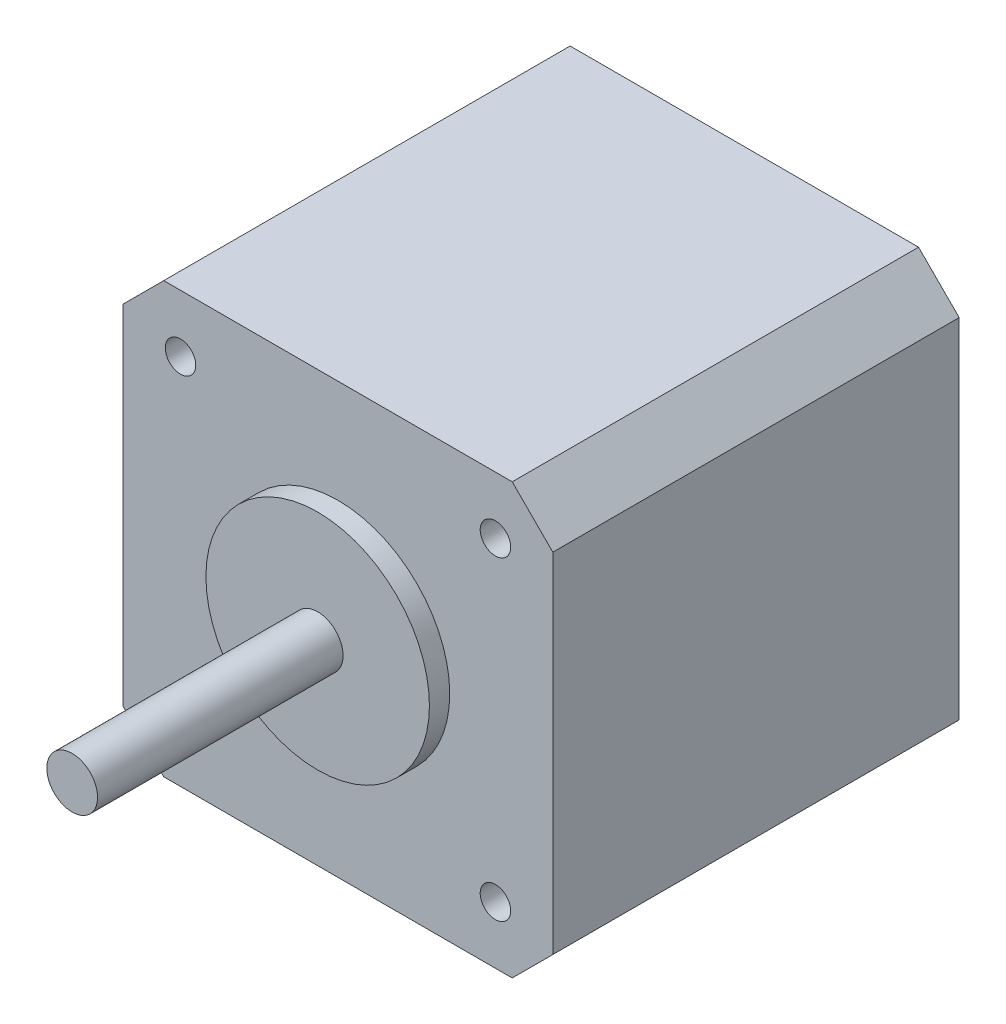
ISO-10303-21;
HEADER;
FILE_DESCRIPTION(('STEP AP214'),'2;1');
FILE_NAME('part.step','',(''),(''),'','','');
FILE_SCHEMA(('AUTOMOTIVE_DESIGN { 1 0 10303 214 1 1 1 1 }'));
ENDSEC;
DATA;
#1=APPLICATION_CONTEXT('core data for automotive mechanical design processes');
#2=APPLICATION_PROTOCOL_DEFINITION('international standard','automotive_design',2000,#1);
#3=PRODUCT_CONTEXT('',#1,'mechanical');
#4=PRODUCT('Part','Part','',(#3));
#5=PRODUCT_RELATED_PRODUCT_CATEGORY('part','',(#4));
#6=PRODUCT_DEFINITION_FORMATION('','',#4);
#7=PRODUCT_DEFINITION_CONTEXT('part definition',#1,'design');
#8=PRODUCT_DEFINITION('design','',#6,#7);
#9=PRODUCT_DEFINITION_SHAPE('','',#8);
#10=(LENGTH_UNIT() NAMED_UNIT(*) SI_UNIT(.MILLI.,.METRE.));
#11=(NAMED_UNIT(*) PLANE_ANGLE_UNIT() SI_UNIT($,.RADIAN.));
#12=(NAMED_UNIT(*) SI_UNIT($,.STERADIAN.) SOLID_ANGLE_UNIT());
#13=UNCERTAINTY_MEASURE_WITH_UNIT(LENGTH_MEASURE(1.E-05),#10,'distance_accuracy_value','');
#14=(GEOMETRIC_REPRESENTATION_CONTEXT(3) GLOBAL_UNCERTAINTY_ASSIGNED_CONTEXT((#13)) GLOBAL_UNIT_ASSIGNED_CONTEXT((#10,
#11,#12)) REPRESENTATION_CONTEXT('',''));
#15=CARTESIAN_POINT('',(0.,0.,0.));
#16=DIRECTION('',(0.,0.,1.));
#17=DIRECTION('',(1.,0.,0.));
#18=AXIS2_PLACEMENT_3D('',#15,#16,#17);
#19=CARTESIAN_POINT('',(0.,0.,0.));
#20=DIRECTION('',(0.,0.,1.));
#21=DIRECTION('',(1.,0.,0.));
#22=AXIS2_PLACEMENT_3D('',#19,#20,#21);
#23=PLANE('',#22);
#24=CARTESIAN_POINT('',(-15.5,-15.5,0.));
#25=DIRECTION('',(0.,0.,1.));
#26=DIRECTION('',(1.,0.,0.));
#27=AXIS2_PLACEMENT_3D('',#24,#25,#26);
#28=CIRCLE('',#27,1.5);
#29=CARTESIAN_POINT('',(-14.,-15.5,0.));
#30=VERTEX_POINT('',#29);
#31=EDGE_CURVE('E212',#30,#30,#28,.T.);
#32=ORIENTED_EDGE('',*,*,#31,.F.);
#33=EDGE_LOOP('',(#32));
#34=FACE_BOUND('',#33,.T.);
#35=CARTESIAN_POINT('',(15.5,-15.5,0.));
#36=DIRECTION('',(0.,0.,1.));
#37=DIRECTION('',(1.,0.,0.));
#38=AXIS2_PLACEMENT_3D('',#35,#36,#37);
#39=CIRCLE('',#38,1.5);
#40=CARTESIAN_POINT('',(17.,-15.5,0.));
#41=VERTEX_POINT('',#40);
#42=EDGE_CURVE('E206',#41,#41,#39,.T.);
#43=ORIENTED_EDGE('',*,*,#42,.F.);
#44=EDGE_LOOP('',(#43));
#45=FACE_BOUND('',#44,.T.);
#46=CARTESIAN_POINT('',(15.5,15.5,0.));
#47=DIRECTION('',(0.,0.,1.));
#48=DIRECTION('',(1.,0.,0.));
#49=AXIS2_PLACEMENT_3D('',#46,#47,#48);
#50=CIRCLE('',#49,1.5);
#51=CARTESIAN_POINT('',(17.,15.5,0.));
#52=VERTEX_POINT('',#51);
#53=EDGE_CURVE('E200',#52,#52,#50,.T.);
#54=ORIENTED_EDGE('',*,*,#53,.F.);
#55=EDGE_LOOP('',(#54));
#56=FACE_BOUND('',#55,.T.);
#57=CARTESIAN_POINT('',(-15.5,15.5,0.));
#58=DIRECTION('',(0.,0.,1.));
#59=DIRECTION('',(1.,0.,0.));
#60=AXIS2_PLACEMENT_3D('',#57,#58,#59);
#61=CIRCLE('',#60,1.5);
#62=CARTESIAN_POINT('',(-14.,15.5,0.));
#63=VERTEX_POINT('',#62);
#64=EDGE_CURVE('E194',#63,#63,#61,.T.);
#65=ORIENTED_EDGE('',*,*,#64,.F.);
#66=EDGE_LOOP('',(#65));
#67=FACE_BOUND('',#66,.T.);
#68=DIRECTION('',(0.,1.,0.));
#69=VECTOR('',#68,1.);
#70=CARTESIAN_POINT('',(21.15,21.15,0.));
#71=LINE('',#70,#69);
#72=CARTESIAN_POINT('',(21.15,-17.15,0.));
#73=VERTEX_POINT('',#72);
#74=CARTESIAN_POINT('',(21.15,17.15,0.));
#75=VERTEX_POINT('',#74);
#76=EDGE_CURVE('E103',#73,#75,#71,.T.);
#77=ORIENTED_EDGE('',*,*,#76,.T.);
#78=DIRECTION('',(0.707106781186546,-0.707106781186549,0.));
#79=VECTOR('',#78,1.);
#80=CARTESIAN_POINT('',(19.15,19.15,0.));
#81=LINE('',#80,#79);
#82=CARTESIAN_POINT('',(17.15,21.15,0.));
#83=VERTEX_POINT('',#82);
#84=EDGE_CURVE('E109',#75,#83,#81,.F.);
#85=ORIENTED_EDGE('',*,*,#84,.T.);
#86=DIRECTION('',(-1.,0.,0.));
#87=VECTOR('',#86,1.);
#88=CARTESIAN_POINT('',(-21.15,21.15,0.));
#89=LINE('',#88,#87);
#90=CARTESIAN_POINT('',(-17.15,21.15,0.));
#91=VERTEX_POINT('',#90);
#92=EDGE_CURVE('E119',#83,#91,#89,.T.);
#93=ORIENTED_EDGE('',*,*,#92,.T.);
#94=DIRECTION('',(0.707106781186549,0.707106781186546,0.));
#95=VECTOR('',#94,1.);
#96=CARTESIAN_POINT('',(-19.15,19.15,0.));
#97=LINE('',#96,#95);
#98=CARTESIAN_POINT('',(-21.15,17.15,0.));
#99=VERTEX_POINT('',#98);
#100=EDGE_CURVE('E124',#91,#99,#97,.F.);
#101=ORIENTED_EDGE('',*,*,#100,.T.);
#102=DIRECTION('',(0.,-1.,0.));
#103=VECTOR('',#102,1.);
#104=CARTESIAN_POINT('',(-21.15,21.15,0.));
#105=LINE('',#104,#103);
#106=CARTESIAN_POINT('',(-21.15,-17.1499999999999,0.));
#107=VERTEX_POINT('',#106);
#108=EDGE_CURVE('E157',#99,#107,#105,.T.);
#109=ORIENTED_EDGE('',*,*,#108,.T.);
#110=DIRECTION('',(-0.707106781186548,0.707106781186548,0.));
#111=VECTOR('',#110,1.);
#112=CARTESIAN_POINT('',(-19.15,-19.15,0.));
#113=LINE('',#112,#111);
#114=CARTESIAN_POINT('',(-17.15,-21.15,0.));
#115=VERTEX_POINT('',#114);
#116=EDGE_CURVE('E110',#107,#115,#113,.F.);
#117=ORIENTED_EDGE('',*,*,#116,.T.);
#118=DIRECTION('',(1.,0.,0.));
#119=VECTOR('',#118,1.);
#120=CARTESIAN_POINT('',(-21.15,-21.15,0.));
#121=LINE('',#120,#119);
#122=CARTESIAN_POINT('',(17.15,-21.15,0.));
#123=VERTEX_POINT('',#122);
#124=EDGE_CURVE('E104',#115,#123,#121,.T.);
#125=ORIENTED_EDGE('',*,*,#124,.T.);
#126=DIRECTION('',(-0.707106781186548,-0.707106781186548,0.));
#127=VECTOR('',#126,1.);
#128=CARTESIAN_POINT('',(19.15,-19.15,0.));
#129=LINE('',#128,#127);
#130=EDGE_CURVE('E100',#123,#73,#129,.F.);
#131=ORIENTED_EDGE('',*,*,#130,.T.);
#132=EDGE_LOOP('',(#77,#85,#93,#101,#109,#117,#125,#131));
#133=FACE_BOUND('',#132,.T.);
#134=CARTESIAN_POINT('',(0.,0.,0.));
#135=DIRECTION('',(0.,0.,-1.));
#136=DIRECTION('',(-1.,0.,0.));
#137=AXIS2_PLACEMENT_3D('',#134,#135,#136);
#138=CIRCLE('',#137,11.);
#139=CARTESIAN_POINT('',(-11.,0.,0.));
#140=VERTEX_POINT('',#139);
#141=EDGE_CURVE('E190',#140,#140,#138,.T.);
#142=ORIENTED_EDGE('',*,*,#141,.T.);
#143=EDGE_LOOP('',(#142));
#144=FACE_BOUND('',#143,.T.);
#145=ADVANCED_FACE('F33',(#34,#45,#56,#67,#133,#144),#23,.T.);
#146=CARTESIAN_POINT('',(-21.15,21.15,-40.));
#147=DIRECTION('',(-1.,0.,0.));
#148=DIRECTION('',(0.,-1.,0.));
#149=AXIS2_PLACEMENT_3D('',#146,#147,#148);
#150=PLANE('',#149);
#151=DIRECTION('',(0.,-1.,0.));
#152=VECTOR('',#151,1.);
#153=CARTESIAN_POINT('',(-21.15,21.15,-40.));
#154=LINE('',#153,#152);
#155=CARTESIAN_POINT('',(-21.15,17.15,-40.));
#156=VERTEX_POINT('',#155);
#157=CARTESIAN_POINT('',(-21.15,-17.15,-40.));
#158=VERTEX_POINT('',#157);
#159=EDGE_CURVE('E154',#156,#158,#154,.T.);
#160=ORIENTED_EDGE('',*,*,#159,.T.);
#161=DIRECTION('',(0.,0.,1.));
#162=VECTOR('',#161,1.);
#163=CARTESIAN_POINT('',(-21.15,-17.15,-40.));
#164=LINE('',#163,#162);
#165=EDGE_CURVE('E11',#158,#107,#164,.T.);
#166=ORIENTED_EDGE('',*,*,#165,.T.);
#167=ORIENTED_EDGE('',*,*,#108,.F.);
#168=DIRECTION('',(0.,0.,-1.));
#169=VECTOR('',#168,1.);
#170=CARTESIAN_POINT('',(-21.15,17.15,-40.));
#171=LINE('',#170,#169);
#172=EDGE_CURVE('E41',#99,#156,#171,.T.);
#173=ORIENTED_EDGE('',*,*,#172,.T.);
#174=EDGE_LOOP('',(#160,#166,#167,#173));
#175=FACE_BOUND('',#174,.T.);
#176=ADVANCED_FACE('F153',(#175),#150,.T.);
#177=CARTESIAN_POINT('',(-21.15,21.15,-40.));
#178=DIRECTION('',(0.,1.,0.));
#179=DIRECTION('',(0.,0.,1.));
#180=AXIS2_PLACEMENT_3D('',#177,#178,#179);
#181=PLANE('',#180);
#182=ORIENTED_EDGE('',*,*,#92,.F.);
#183=DIRECTION('',(0.,0.,-1.));
#184=VECTOR('',#183,1.);
#185=CARTESIAN_POINT('',(17.15,21.15,-40.));
#186=LINE('',#185,#184);
#187=CARTESIAN_POINT('',(17.15,21.15,-40.));
#188=VERTEX_POINT('',#187);
#189=EDGE_CURVE('E137',#83,#188,#186,.T.);
#190=ORIENTED_EDGE('',*,*,#189,.T.);
#191=DIRECTION('',(-1.,0.,0.));
#192=VECTOR('',#191,1.);
#193=CARTESIAN_POINT('',(-21.15,21.15,-40.));
#194=LINE('',#193,#192);
#195=CARTESIAN_POINT('',(-17.15,21.15,-40.));
#196=VERTEX_POINT('',#195);
#197=EDGE_CURVE('E122',#188,#196,#194,.T.);
#198=ORIENTED_EDGE('',*,*,#197,.T.);
#199=DIRECTION('',(0.,0.,1.));
#200=VECTOR('',#199,1.);
#201=CARTESIAN_POINT('',(-17.15,21.15,-40.));
#202=LINE('',#201,#200);
#203=EDGE_CURVE('E134',#196,#91,#202,.T.);
#204=ORIENTED_EDGE('',*,*,#203,.T.);
#205=EDGE_LOOP('',(#182,#190,#198,#204));
#206=FACE_BOUND('',#205,.T.);
#207=ADVANCED_FACE('F169',(#206),#181,.T.);
#208=CARTESIAN_POINT('',(21.15,21.15,-40.));
#209=DIRECTION('',(1.,0.,0.));
#210=DIRECTION('',(0.,1.,0.));
#211=AXIS2_PLACEMENT_3D('',#208,#209,#210);
#212=PLANE('',#211);
#213=DIRECTION('',(0.,1.,0.));
#214=VECTOR('',#213,1.);
#215=CARTESIAN_POINT('',(21.15,21.15,-40.));
#216=LINE('',#215,#214);
#217=CARTESIAN_POINT('',(21.15,-17.15,-40.));
#218=VERTEX_POINT('',#217);
#219=CARTESIAN_POINT('',(21.15,17.15,-40.));
#220=VERTEX_POINT('',#219);
#221=EDGE_CURVE('E127',#218,#220,#216,.T.);
#222=ORIENTED_EDGE('',*,*,#221,.T.);
#223=DIRECTION('',(0.,0.,1.));
#224=VECTOR('',#223,1.);
#225=CARTESIAN_POINT('',(21.15,17.15,-40.));
#226=LINE('',#225,#224);
#227=EDGE_CURVE('E118',#220,#75,#226,.T.);
#228=ORIENTED_EDGE('',*,*,#227,.T.);
#229=ORIENTED_EDGE('',*,*,#76,.F.);
#230=DIRECTION('',(0.,0.,-1.));
#231=VECTOR('',#230,1.);
#232=CARTESIAN_POINT('',(21.15,-17.15,-40.));
#233=LINE('',#232,#231);
#234=EDGE_CURVE('E116',#73,#218,#233,.T.);
#235=ORIENTED_EDGE('',*,*,#234,.T.);
#236=EDGE_LOOP('',(#222,#228,#229,#235));
#237=FACE_BOUND('',#236,.T.);
#238=ADVANCED_FACE('F115',(#237),#212,.T.);
#239=CARTESIAN_POINT('',(-21.15,-21.15,-40.));
#240=DIRECTION('',(0.,-1.,0.));
#241=DIRECTION('',(0.,0.,-1.));
#242=AXIS2_PLACEMENT_3D('',#239,#240,#241);
#243=PLANE('',#242);
#244=DIRECTION('',(1.,0.,0.));
#245=VECTOR('',#244,1.);
#246=CARTESIAN_POINT('',(-21.15,-21.15,-40.));
#247=LINE('',#246,#245);
#248=CARTESIAN_POINT('',(-17.15,-21.15,-40.));
#249=VERTEX_POINT('',#248);
#250=CARTESIAN_POINT('',(17.15,-21.15,-40.));
#251=VERTEX_POINT('',#250);
#252=EDGE_CURVE('E163',#249,#251,#247,.T.);
#253=ORIENTED_EDGE('',*,*,#252,.T.);
#254=DIRECTION('',(0.,0.,1.));
#255=VECTOR('',#254,1.);
#256=CARTESIAN_POINT('',(17.15,-21.15,-40.));
#257=LINE('',#256,#255);
#258=EDGE_CURVE('E147',#251,#123,#257,.T.);
#259=ORIENTED_EDGE('',*,*,#258,.T.);
#260=ORIENTED_EDGE('',*,*,#124,.F.);
#261=DIRECTION('',(0.,0.,-1.));
#262=VECTOR('',#261,1.);
#263=CARTESIAN_POINT('',(-17.15,-21.15,-40.));
#264=LINE('',#263,#262);
#265=EDGE_CURVE('E55',#115,#249,#264,.T.);
#266=ORIENTED_EDGE('',*,*,#265,.T.);
#267=EDGE_LOOP('',(#253,#259,#260,#266));
#268=FACE_BOUND('',#267,.T.);
#269=ADVANCED_FACE('F235',(#268),#243,.T.);
#270=CARTESIAN_POINT('',(0.,0.,-40.));
#271=DIRECTION('',(0.,0.,1.));
#272=DIRECTION('',(1.,0.,0.));
#273=AXIS2_PLACEMENT_3D('',#270,#271,#272);
#274=PLANE('',#273);
#275=CARTESIAN_POINT('',(0.,0.,-40.));
#276=DIRECTION('',(0.,0.,-1.));
#277=DIRECTION('',(-1.,0.,0.));
#278=AXIS2_PLACEMENT_3D('',#275,#276,#277);
#279=CIRCLE('',#278,4.625);
#280=CARTESIAN_POINT('',(-4.625,0.,-40.));
#281=VERTEX_POINT('',#280);
#282=EDGE_CURVE('E218',#281,#281,#279,.T.);
#283=ORIENTED_EDGE('',*,*,#282,.F.);
#284=EDGE_LOOP('',(#283));
#285=FACE_BOUND('',#284,.T.);
#286=ORIENTED_EDGE('',*,*,#197,.F.);
#287=DIRECTION('',(-0.707106781186546,0.707106781186549,0.));
#288=VECTOR('',#287,1.);
#289=CARTESIAN_POINT('',(21.15,17.15,-40.));
#290=LINE('',#289,#288);
#291=EDGE_CURVE('E144',#188,#220,#290,.F.);
#292=ORIENTED_EDGE('',*,*,#291,.T.);
#293=ORIENTED_EDGE('',*,*,#221,.F.);
#294=DIRECTION('',(0.707106781186548,0.707106781186548,0.));
#295=VECTOR('',#294,1.);
#296=CARTESIAN_POINT('',(17.15,-21.15,-40.));
#297=LINE('',#296,#295);
#298=EDGE_CURVE('E48',#218,#251,#297,.F.);
#299=ORIENTED_EDGE('',*,*,#298,.T.);
#300=ORIENTED_EDGE('',*,*,#252,.F.);
#301=DIRECTION('',(0.707106781186548,-0.707106781186548,0.));
#302=VECTOR('',#301,1.);
#303=CARTESIAN_POINT('',(-21.15,-17.15,-40.));
#304=LINE('',#303,#302);
#305=EDGE_CURVE('E141',#249,#158,#304,.F.);
#306=ORIENTED_EDGE('',*,*,#305,.T.);
#307=ORIENTED_EDGE('',*,*,#159,.F.);
#308=DIRECTION('',(-0.707106781186549,-0.707106781186546,0.));
#309=VECTOR('',#308,1.);
#310=CARTESIAN_POINT('',(-17.15,21.15,-40.));
#311=LINE('',#310,#309);
#312=EDGE_CURVE('E139',#156,#196,#311,.F.);
#313=ORIENTED_EDGE('',*,*,#312,.T.);
#314=EDGE_LOOP('',(#286,#292,#293,#299,#300,#306,#307,#313));
#315=FACE_BOUND('',#314,.T.);
#316=ADVANCED_FACE('F161',(#285,#315),#274,.F.);
#317=CARTESIAN_POINT('',(0.,0.,26.1637247331365));
#318=DIRECTION('',(0.,0.,-1.));
#319=DIRECTION('',(-1.,0.,0.));
#320=AXIS2_PLACEMENT_3D('',#317,#318,#319);
#321=PLANE('',#320);
#322=CARTESIAN_POINT('',(0.,0.,26.1637247331365));
#323=DIRECTION('',(0.,0.,-1.));
#324=DIRECTION('',(-1.,0.,0.));
#325=AXIS2_PLACEMENT_3D('',#322,#323,#324);
#326=CIRCLE('',#325,2.5);
#327=CARTESIAN_POINT('',(-2.5,0.,26.1637247331365));
#328=VERTEX_POINT('',#327);
#329=EDGE_CURVE('E178',#328,#328,#326,.T.);
#330=ORIENTED_EDGE('',*,*,#329,.F.);
#331=EDGE_LOOP('',(#330));
#332=FACE_BOUND('',#331,.T.);
#333=ADVANCED_FACE('F234',(#332),#321,.F.);
#334=CARTESIAN_POINT('',(0.,0.,0.));
#335=DIRECTION('',(0.,0.,-1.));
#336=DIRECTION('',(-1.,0.,0.));
#337=AXIS2_PLACEMENT_3D('',#334,#335,#336);
#338=CYLINDRICAL_SURFACE('',#337,2.5);
#339=CARTESIAN_POINT('',(0.,0.,2.));
#340=DIRECTION('',(0.,0.,-1.));
#341=DIRECTION('',(-1.,0.,0.));
#342=AXIS2_PLACEMENT_3D('',#339,#340,#341);
#343=CIRCLE('',#342,2.5);
#344=CARTESIAN_POINT('',(-2.5,0.,2.));
#345=VERTEX_POINT('',#344);
#346=EDGE_CURVE('E180',#345,#345,#343,.T.);
#347=ORIENTED_EDGE('',*,*,#346,.F.);
#348=EDGE_LOOP('',(#347));
#349=FACE_BOUND('',#348,.T.);
#350=ORIENTED_EDGE('',*,*,#329,.T.);
#351=EDGE_LOOP('',(#350));
#352=FACE_BOUND('',#351,.T.);
#353=ADVANCED_FACE('F241',(#349,#352),#338,.T.);
#354=CARTESIAN_POINT('',(11.,0.,2.));
#355=DIRECTION('',(0.,0.,-1.));
#356=DIRECTION('',(-1.,0.,0.));
#357=AXIS2_PLACEMENT_3D('',#354,#355,#356);
#358=PLANE('',#357);
#359=CARTESIAN_POINT('',(0.,0.,2.));
#360=DIRECTION('',(0.,0.,-1.));
#361=DIRECTION('',(-1.,0.,0.));
#362=AXIS2_PLACEMENT_3D('',#359,#360,#361);
#363=CIRCLE('',#362,11.);
#364=CARTESIAN_POINT('',(-11.,0.,2.));
#365=VERTEX_POINT('',#364);
#366=EDGE_CURVE('E185',#365,#365,#363,.T.);
#367=ORIENTED_EDGE('',*,*,#366,.F.);
#368=EDGE_LOOP('',(#367));
#369=FACE_BOUND('',#368,.T.);
#370=ORIENTED_EDGE('',*,*,#346,.T.);
#371=EDGE_LOOP('',(#370));
#372=FACE_BOUND('',#371,.T.);
#373=ADVANCED_FACE('F288',(#369,#372),#358,.F.);
#374=CARTESIAN_POINT('',(0.,0.,0.));
#375=DIRECTION('',(0.,0.,-1.));
#376=DIRECTION('',(-1.,0.,0.));
#377=AXIS2_PLACEMENT_3D('',#374,#375,#376);
#378=CYLINDRICAL_SURFACE('',#377,11.);
#379=ORIENTED_EDGE('',*,*,#141,.F.);
#380=EDGE_LOOP('',(#379));
#381=FACE_BOUND('',#380,.T.);
#382=ORIENTED_EDGE('',*,*,#366,.T.);
#383=EDGE_LOOP('',(#382));
#384=FACE_BOUND('',#383,.T.);
#385=ADVANCED_FACE('F261',(#381,#384),#378,.T.);
#386=CARTESIAN_POINT('',(21.15,17.15,-40.));
#387=DIRECTION('',(-0.707106781186549,-0.707106781186546,0.));
#388=DIRECTION('',(0.,0.,1.));
#389=AXIS2_PLACEMENT_3D('',#386,#387,#388);
#390=PLANE('',#389);
#391=ORIENTED_EDGE('',*,*,#291,.F.);
#392=ORIENTED_EDGE('',*,*,#189,.F.);
#393=ORIENTED_EDGE('',*,*,#84,.F.);
#394=ORIENTED_EDGE('',*,*,#227,.F.);
#395=EDGE_LOOP('',(#391,#392,#393,#394));
#396=FACE_BOUND('',#395,.T.);
#397=ADVANCED_FACE('F173',(#396),#390,.F.);
#398=CARTESIAN_POINT('',(17.15,-21.15,-40.));
#399=DIRECTION('',(-0.707106781186547,0.707106781186547,0.));
#400=DIRECTION('',(0.,0.,1.));
#401=AXIS2_PLACEMENT_3D('',#398,#399,#400);
#402=PLANE('',#401);
#403=ORIENTED_EDGE('',*,*,#298,.F.);
#404=ORIENTED_EDGE('',*,*,#234,.F.);
#405=ORIENTED_EDGE('',*,*,#130,.F.);
#406=ORIENTED_EDGE('',*,*,#258,.F.);
#407=EDGE_LOOP('',(#403,#404,#405,#406));
#408=FACE_BOUND('',#407,.T.);
#409=ADVANCED_FACE('F121',(#408),#402,.F.);
#410=CARTESIAN_POINT('',(-21.15,-17.15,-40.));
#411=DIRECTION('',(0.707106781186548,0.707106781186548,0.));
#412=DIRECTION('',(0.,0.,1.));
#413=AXIS2_PLACEMENT_3D('',#410,#411,#412);
#414=PLANE('',#413);
#415=ORIENTED_EDGE('',*,*,#305,.F.);
#416=ORIENTED_EDGE('',*,*,#265,.F.);
#417=ORIENTED_EDGE('',*,*,#116,.F.);
#418=ORIENTED_EDGE('',*,*,#165,.F.);
#419=EDGE_LOOP('',(#415,#416,#417,#418));
#420=FACE_BOUND('',#419,.T.);
#421=ADVANCED_FACE('F263',(#420),#414,.F.);
#422=CARTESIAN_POINT('',(-17.15,21.15,-40.));
#423=DIRECTION('',(0.707106781186546,-0.707106781186549,0.));
#424=DIRECTION('',(0.,0.,1.));
#425=AXIS2_PLACEMENT_3D('',#422,#423,#424);
#426=PLANE('',#425);
#427=ORIENTED_EDGE('',*,*,#312,.F.);
#428=ORIENTED_EDGE('',*,*,#172,.F.);
#429=ORIENTED_EDGE('',*,*,#100,.F.);
#430=ORIENTED_EDGE('',*,*,#203,.F.);
#431=EDGE_LOOP('',(#427,#428,#429,#430));
#432=FACE_BOUND('',#431,.T.);
#433=ADVANCED_FACE('F35',(#432),#426,.F.);
#434=CARTESIAN_POINT('',(-15.5,15.5,-5.));
#435=DIRECTION('',(0.,0.,1.));
#436=DIRECTION('',(1.,0.,0.));
#437=AXIS2_PLACEMENT_3D('',#434,#435,#436);
#438=CYLINDRICAL_SURFACE('',#437,1.5);
#439=CARTESIAN_POINT('',(-15.5,15.5,-5.));
#440=DIRECTION('',(0.,0.,1.));
#441=DIRECTION('',(1.,0.,0.));
#442=AXIS2_PLACEMENT_3D('',#439,#440,#441);
#443=CIRCLE('',#442,1.5);
#444=CARTESIAN_POINT('',(-14.,15.5,-5.));
#445=VERTEX_POINT('',#444);
#446=EDGE_CURVE('E193',#445,#445,#443,.T.);
#447=ORIENTED_EDGE('',*,*,#446,.F.);
#448=EDGE_LOOP('',(#447));
#449=FACE_BOUND('',#448,.T.);
#450=ORIENTED_EDGE('',*,*,#64,.T.);
#451=EDGE_LOOP('',(#450));
#452=FACE_BOUND('',#451,.T.);
#453=ADVANCED_FACE('F269',(#449,#452),#438,.F.);
#454=CARTESIAN_POINT('',(-15.5,15.5,-5.));
#455=DIRECTION('',(0.,0.,1.));
#456=DIRECTION('',(1.,0.,0.));
#457=AXIS2_PLACEMENT_3D('',#454,#455,#456);
#458=PLANE('',#457);
#459=ORIENTED_EDGE('',*,*,#446,.T.);
#460=EDGE_LOOP('',(#459));
#461=FACE_BOUND('',#460,.T.);
#462=ADVANCED_FACE('F273',(#461),#458,.T.);
#463=CARTESIAN_POINT('',(15.5,15.5,-5.));
#464=DIRECTION('',(0.,0.,1.));
#465=DIRECTION('',(1.,0.,0.));
#466=AXIS2_PLACEMENT_3D('',#463,#464,#465);
#467=CYLINDRICAL_SURFACE('',#466,1.5);
#468=CARTESIAN_POINT('',(15.5,15.5,-5.));
#469=DIRECTION('',(0.,0.,1.));
#470=DIRECTION('',(1.,0.,0.));
#471=AXIS2_PLACEMENT_3D('',#468,#469,#470);
#472=CIRCLE('',#471,1.5);
#473=CARTESIAN_POINT('',(17.,15.5,-5.));
#474=VERTEX_POINT('',#473);
#475=EDGE_CURVE('E197',#474,#474,#472,.T.);
#476=ORIENTED_EDGE('',*,*,#475,.F.);
#477=EDGE_LOOP('',(#476));
#478=FACE_BOUND('',#477,.T.);
#479=ORIENTED_EDGE('',*,*,#53,.T.);
#480=EDGE_LOOP('',(#479));
#481=FACE_BOUND('',#480,.T.);
#482=ADVANCED_FACE('F279',(#478,#481),#467,.F.);
#483=CARTESIAN_POINT('',(15.5,15.5,-5.));
#484=DIRECTION('',(0.,0.,1.));
#485=DIRECTION('',(1.,0.,0.));
#486=AXIS2_PLACEMENT_3D('',#483,#484,#485);
#487=PLANE('',#486);
#488=ORIENTED_EDGE('',*,*,#475,.T.);
#489=EDGE_LOOP('',(#488));
#490=FACE_BOUND('',#489,.T.);
#491=ADVANCED_FACE('F350',(#490),#487,.T.);
#492=CARTESIAN_POINT('',(15.5,-15.5,-5.));
#493=DIRECTION('',(0.,0.,1.));
#494=DIRECTION('',(1.,0.,0.));
#495=AXIS2_PLACEMENT_3D('',#492,#493,#494);
#496=CYLINDRICAL_SURFACE('',#495,1.5);
#497=CARTESIAN_POINT('',(15.5,-15.5,-5.));
#498=DIRECTION('',(0.,0.,1.));
#499=DIRECTION('',(1.,0.,0.));
#500=AXIS2_PLACEMENT_3D('',#497,#498,#499);
#501=CIRCLE('',#500,1.5);
#502=CARTESIAN_POINT('',(17.,-15.5,-5.));
#503=VERTEX_POINT('',#502);
#504=EDGE_CURVE('E203',#503,#503,#501,.T.);
#505=ORIENTED_EDGE('',*,*,#504,.F.);
#506=EDGE_LOOP('',(#505));
#507=FACE_BOUND('',#506,.T.);
#508=ORIENTED_EDGE('',*,*,#42,.T.);
#509=EDGE_LOOP('',(#508));
#510=FACE_BOUND('',#509,.T.);
#511=ADVANCED_FACE('F359',(#507,#510),#496,.F.);
#512=CARTESIAN_POINT('',(15.5,-15.5,-5.));
#513=DIRECTION('',(0.,0.,1.));
#514=DIRECTION('',(1.,0.,0.));
#515=AXIS2_PLACEMENT_3D('',#512,#513,#514);
#516=PLANE('',#515);
#517=ORIENTED_EDGE('',*,*,#504,.T.);
#518=EDGE_LOOP('',(#517));
#519=FACE_BOUND('',#518,.T.);
#520=ADVANCED_FACE('F369',(#519),#516,.T.);
#521=CARTESIAN_POINT('',(-15.5,-15.5,-5.));
#522=DIRECTION('',(0.,0.,1.));
#523=DIRECTION('',(1.,0.,0.));
#524=AXIS2_PLACEMENT_3D('',#521,#522,#523);
#525=CYLINDRICAL_SURFACE('',#524,1.5);
#526=CARTESIAN_POINT('',(-15.5,-15.5,-5.));
#527=DIRECTION('',(0.,0.,1.));
#528=DIRECTION('',(1.,0.,0.));
#529=AXIS2_PLACEMENT_3D('',#526,#527,#528);
#530=CIRCLE('',#529,1.5);
#531=CARTESIAN_POINT('',(-14.,-15.5,-5.));
#532=VERTEX_POINT('',#531);
#533=EDGE_CURVE('E209',#532,#532,#530,.T.);
#534=ORIENTED_EDGE('',*,*,#533,.F.);
#535=EDGE_LOOP('',(#534));
#536=FACE_BOUND('',#535,.T.);
#537=ORIENTED_EDGE('',*,*,#31,.T.);
#538=EDGE_LOOP('',(#537));
#539=FACE_BOUND('',#538,.T.);
#540=ADVANCED_FACE('F379',(#536,#539),#525,.F.);
#541=CARTESIAN_POINT('',(-15.5,-15.5,-5.));
#542=DIRECTION('',(0.,0.,1.));
#543=DIRECTION('',(1.,0.,0.));
#544=AXIS2_PLACEMENT_3D('',#541,#542,#543);
#545=PLANE('',#544);
#546=ORIENTED_EDGE('',*,*,#533,.T.);
#547=EDGE_LOOP('',(#546));
#548=FACE_BOUND('',#547,.T.);
#549=ADVANCED_FACE('F229',(#548),#545,.T.);
#550=CARTESIAN_POINT('',(0.,0.,-36.5));
#551=DIRECTION('',(0.,0.,-1.));
#552=DIRECTION('',(-1.,0.,0.));
#553=AXIS2_PLACEMENT_3D('',#550,#551,#552);
#554=CYLINDRICAL_SURFACE('',#553,4.625);
#555=CARTESIAN_POINT('',(0.,0.,-36.5));
#556=DIRECTION('',(0.,0.,-1.));
#557=DIRECTION('',(-1.,0.,0.));
#558=AXIS2_PLACEMENT_3D('',#555,#556,#557);
#559=CIRCLE('',#558,4.625);
#560=CARTESIAN_POINT('',(-4.625,0.,-36.5));
#561=VERTEX_POINT('',#560);
#562=EDGE_CURVE('E215',#561,#561,#559,.T.);
#563=ORIENTED_EDGE('',*,*,#562,.F.);
#564=EDGE_LOOP('',(#563));
#565=FACE_BOUND('',#564,.T.);
#566=ORIENTED_EDGE('',*,*,#282,.T.);
#567=EDGE_LOOP('',(#566));
#568=FACE_BOUND('',#567,.T.);
#569=ADVANCED_FACE('F226',(#565,#568),#554,.F.);
#570=CARTESIAN_POINT('',(0.,0.,-36.5));
#571=DIRECTION('',(0.,0.,-1.));
#572=DIRECTION('',(-1.,0.,0.));
#573=AXIS2_PLACEMENT_3D('',#570,#571,#572);
#574=PLANE('',#573);
#575=ORIENTED_EDGE('',*,*,#562,.T.);
#576=EDGE_LOOP('',(#575));
#577=FACE_BOUND('',#576,.T.);
#578=ADVANCED_FACE('F224',(#577),#574,.T.);
#579=CLOSED_SHELL('',(#145,#176,#207,#238,#269,#316,#333,#353,#373,#385,#397,#409,#421,#433,
#453,#462,#482,#491,#511,#520,#540,#549,#569,#578));
#580=MANIFOLD_SOLID_BREP('B2',#579);
#581=ADVANCED_BREP_SHAPE_REPRESENTATION('',(#18,#580),#14);
#582=SHAPE_DEFINITION_REPRESENTATION(#9,#581);
ENDSEC;
END-ISO-10303-21;
